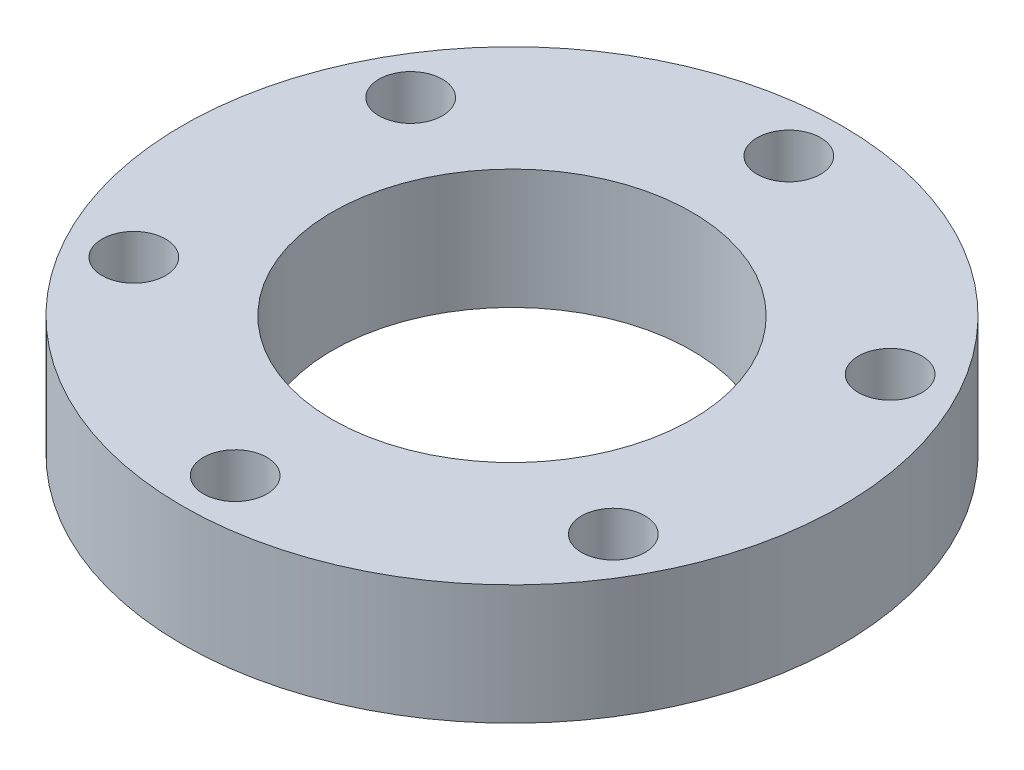
ISO-10303-21;
HEADER;
FILE_DESCRIPTION(('STEP AP214'),'2;1');
FILE_NAME('part.step','',(''),(''),'','','');
FILE_SCHEMA(('AUTOMOTIVE_DESIGN { 1 0 10303 214 1 1 1 1 }'));
ENDSEC;
DATA;
#1=APPLICATION_CONTEXT('core data for automotive mechanical design processes');
#2=APPLICATION_PROTOCOL_DEFINITION('international standard','automotive_design',2000,#1);
#3=PRODUCT_CONTEXT('',#1,'mechanical');
#4=PRODUCT('Part','Part','',(#3));
#5=PRODUCT_RELATED_PRODUCT_CATEGORY('part','',(#4));
#6=PRODUCT_DEFINITION_FORMATION('','',#4);
#7=PRODUCT_DEFINITION_CONTEXT('part definition',#1,'design');
#8=PRODUCT_DEFINITION('design','',#6,#7);
#9=PRODUCT_DEFINITION_SHAPE('','',#8);
#10=(LENGTH_UNIT() NAMED_UNIT(*) SI_UNIT(.MILLI.,.METRE.));
#11=(NAMED_UNIT(*) PLANE_ANGLE_UNIT() SI_UNIT($,.RADIAN.));
#12=(NAMED_UNIT(*) SI_UNIT($,.STERADIAN.) SOLID_ANGLE_UNIT());
#13=UNCERTAINTY_MEASURE_WITH_UNIT(LENGTH_MEASURE(1.E-05),#10,'distance_accuracy_value','');
#14=(GEOMETRIC_REPRESENTATION_CONTEXT(3) GLOBAL_UNCERTAINTY_ASSIGNED_CONTEXT((#13)) GLOBAL_UNIT_ASSIGNED_CONTEXT((#10,
#11,#12)) REPRESENTATION_CONTEXT('',''));
#15=CARTESIAN_POINT('',(0.,0.,0.));
#16=DIRECTION('',(0.,0.,1.));
#17=DIRECTION('',(1.,0.,0.));
#18=AXIS2_PLACEMENT_3D('',#15,#16,#17);
#19=CARTESIAN_POINT('',(0.,12.7,0.));
#20=DIRECTION('',(0.,1.,0.));
#21=DIRECTION('',(0.,0.,1.));
#22=AXIS2_PLACEMENT_3D('',#19,#20,#21);
#23=PLANE('',#22);
#24=CARTESIAN_POINT('',(25.4065872708242,12.7,14.6684999999998));
#25=DIRECTION('',(0.,1.,0.));
#26=DIRECTION('',(-0.866025403784443,0.,-0.499999999999992));
#27=AXIS2_PLACEMENT_3D('',#24,#25,#26);
#28=CIRCLE('',#27,3.3655);
#29=CARTESIAN_POINT('',(22.4919787743877,12.7,12.9857499999998));
#30=VERTEX_POINT('',#29);
#31=EDGE_CURVE('E70',#30,#30,#28,.T.);
#32=ORIENTED_EDGE('',*,*,#31,.F.);
#33=EDGE_LOOP('',(#32));
#34=FACE_BOUND('',#33,.T.);
#35=CARTESIAN_POINT('',(-25.406587270824,12.7,14.6685000000001));
#36=DIRECTION('',(0.,1.,0.));
#37=DIRECTION('',(0.866025403784436,0.,-0.500000000000004));
#38=AXIS2_PLACEMENT_3D('',#35,#36,#37);
#39=CIRCLE('',#38,3.3655);
#40=CARTESIAN_POINT('',(-22.4919787743875,12.7,12.9857500000001));
#41=VERTEX_POINT('',#40);
#42=EDGE_CURVE('E58',#41,#41,#39,.T.);
#43=ORIENTED_EDGE('',*,*,#42,.F.);
#44=EDGE_LOOP('',(#43));
#45=FACE_BOUND('',#44,.T.);
#46=CARTESIAN_POINT('',(0.,12.7,-29.337));
#47=DIRECTION('',(0.,1.,0.));
#48=DIRECTION('',(0.,0.,1.));
#49=AXIS2_PLACEMENT_3D('',#46,#47,#48);
#50=CIRCLE('',#49,3.3655);
#51=CARTESIAN_POINT('',(0.,12.7,-25.9715));
#52=VERTEX_POINT('',#51);
#53=EDGE_CURVE('E46',#52,#52,#50,.T.);
#54=ORIENTED_EDGE('',*,*,#53,.F.);
#55=EDGE_LOOP('',(#54));
#56=FACE_BOUND('',#55,.T.);
#57=CARTESIAN_POINT('',(0.,12.7,0.));
#58=DIRECTION('',(0.,1.,0.));
#59=DIRECTION('',(0.,0.,1.));
#60=AXIS2_PLACEMENT_3D('',#57,#58,#59);
#61=CIRCLE('',#60,34.925);
#62=CARTESIAN_POINT('',(0.,12.7,34.925));
#63=VERTEX_POINT('',#62);
#64=EDGE_CURVE('E10',#63,#63,#61,.T.);
#65=ORIENTED_EDGE('',*,*,#64,.T.);
#66=EDGE_LOOP('',(#65));
#67=FACE_BOUND('',#66,.T.);
#68=CARTESIAN_POINT('',(0.,12.7,0.));
#69=DIRECTION('',(0.,1.,0.));
#70=DIRECTION('',(0.,0.,1.));
#71=AXIS2_PLACEMENT_3D('',#68,#69,#70);
#72=CIRCLE('',#71,19.05);
#73=CARTESIAN_POINT('',(0.,12.7,19.05));
#74=VERTEX_POINT('',#73);
#75=EDGE_CURVE('E41',#74,#74,#72,.T.);
#76=ORIENTED_EDGE('',*,*,#75,.F.);
#77=EDGE_LOOP('',(#76));
#78=FACE_BOUND('',#77,.T.);
#79=CARTESIAN_POINT('',(-25.4065872708241,12.7,-14.6684999999999));
#80=DIRECTION('',(0.,1.,0.));
#81=DIRECTION('',(0.86602540378444,0.,0.499999999999998));
#82=AXIS2_PLACEMENT_3D('',#79,#80,#81);
#83=CIRCLE('',#82,3.3655);
#84=CARTESIAN_POINT('',(-22.4919787743876,12.7,-12.9857499999999));
#85=VERTEX_POINT('',#84);
#86=EDGE_CURVE('E52',#85,#85,#83,.T.);
#87=ORIENTED_EDGE('',*,*,#86,.F.);
#88=EDGE_LOOP('',(#87));
#89=FACE_BOUND('',#88,.T.);
#90=CARTESIAN_POINT('',(2.04859176075282E-13,12.7,29.337));
#91=DIRECTION('',(0.,1.,0.));
#92=DIRECTION('',(0.,0.,-1.));
#93=AXIS2_PLACEMENT_3D('',#90,#91,#92);
#94=CIRCLE('',#93,3.3655);
#95=CARTESIAN_POINT('',(1.81358015183529E-13,12.7,25.9715));
#96=VERTEX_POINT('',#95);
#97=EDGE_CURVE('E64',#96,#96,#94,.T.);
#98=ORIENTED_EDGE('',*,*,#97,.F.);
#99=EDGE_LOOP('',(#98));
#100=FACE_BOUND('',#99,.T.);
#101=CARTESIAN_POINT('',(25.4065872708239,12.7,-14.6685000000003));
#102=DIRECTION('',(0.,1.,0.));
#103=DIRECTION('',(-0.866025403784433,0.,0.50000000000001));
#104=AXIS2_PLACEMENT_3D('',#101,#102,#103);
#105=CIRCLE('',#104,3.3655);
#106=CARTESIAN_POINT('',(22.4919787743874,12.7,-12.9857500000003));
#107=VERTEX_POINT('',#106);
#108=EDGE_CURVE('E76',#107,#107,#105,.T.);
#109=ORIENTED_EDGE('',*,*,#108,.F.);
#110=EDGE_LOOP('',(#109));
#111=FACE_BOUND('',#110,.T.);
#112=ADVANCED_FACE('F30',(#34,#45,#56,#67,#78,#89,#100,#111),#23,.T.);
#113=CARTESIAN_POINT('',(0.,0.,0.));
#114=DIRECTION('',(0.,1.,0.));
#115=DIRECTION('',(0.,0.,1.));
#116=AXIS2_PLACEMENT_3D('',#113,#114,#115);
#117=PLANE('',#116);
#118=CARTESIAN_POINT('',(25.4065872708242,0.,14.6684999999998));
#119=DIRECTION('',(0.,1.,0.));
#120=DIRECTION('',(-0.866025403784443,0.,-0.499999999999992));
#121=AXIS2_PLACEMENT_3D('',#118,#119,#120);
#122=CIRCLE('',#121,3.3655);
#123=CARTESIAN_POINT('',(22.4919787743877,0.,12.9857499999998));
#124=VERTEX_POINT('',#123);
#125=EDGE_CURVE('E73',#124,#124,#122,.T.);
#126=ORIENTED_EDGE('',*,*,#125,.T.);
#127=EDGE_LOOP('',(#126));
#128=FACE_BOUND('',#127,.T.);
#129=CARTESIAN_POINT('',(-25.406587270824,0.,14.6685000000001));
#130=DIRECTION('',(0.,1.,0.));
#131=DIRECTION('',(0.866025403784436,0.,-0.500000000000004));
#132=AXIS2_PLACEMENT_3D('',#129,#130,#131);
#133=CIRCLE('',#132,3.3655);
#134=CARTESIAN_POINT('',(-22.4919787743875,0.,12.9857500000001));
#135=VERTEX_POINT('',#134);
#136=EDGE_CURVE('E61',#135,#135,#133,.T.);
#137=ORIENTED_EDGE('',*,*,#136,.T.);
#138=EDGE_LOOP('',(#137));
#139=FACE_BOUND('',#138,.T.);
#140=CARTESIAN_POINT('',(0.,0.,-29.337));
#141=DIRECTION('',(0.,1.,0.));
#142=DIRECTION('',(0.,0.,1.));
#143=AXIS2_PLACEMENT_3D('',#140,#141,#142);
#144=CIRCLE('',#143,3.3655);
#145=CARTESIAN_POINT('',(0.,0.,-25.9715));
#146=VERTEX_POINT('',#145);
#147=EDGE_CURVE('E49',#146,#146,#144,.T.);
#148=ORIENTED_EDGE('',*,*,#147,.T.);
#149=EDGE_LOOP('',(#148));
#150=FACE_BOUND('',#149,.T.);
#151=CARTESIAN_POINT('',(0.,0.,0.));
#152=DIRECTION('',(0.,1.,0.));
#153=DIRECTION('',(0.,0.,1.));
#154=AXIS2_PLACEMENT_3D('',#151,#152,#153);
#155=CIRCLE('',#154,34.925);
#156=CARTESIAN_POINT('',(0.,0.,34.925));
#157=VERTEX_POINT('',#156);
#158=EDGE_CURVE('E34',#157,#157,#155,.T.);
#159=ORIENTED_EDGE('',*,*,#158,.F.);
#160=EDGE_LOOP('',(#159));
#161=FACE_BOUND('',#160,.T.);
#162=CARTESIAN_POINT('',(0.,0.,0.));
#163=DIRECTION('',(0.,1.,0.));
#164=DIRECTION('',(0.,0.,1.));
#165=AXIS2_PLACEMENT_3D('',#162,#163,#164);
#166=CIRCLE('',#165,19.05);
#167=CARTESIAN_POINT('',(0.,0.,19.05));
#168=VERTEX_POINT('',#167);
#169=EDGE_CURVE('E43',#168,#168,#166,.T.);
#170=ORIENTED_EDGE('',*,*,#169,.T.);
#171=EDGE_LOOP('',(#170));
#172=FACE_BOUND('',#171,.T.);
#173=CARTESIAN_POINT('',(-25.4065872708241,0.,-14.6684999999999));
#174=DIRECTION('',(0.,1.,0.));
#175=DIRECTION('',(0.86602540378444,0.,0.499999999999998));
#176=AXIS2_PLACEMENT_3D('',#173,#174,#175);
#177=CIRCLE('',#176,3.3655);
#178=CARTESIAN_POINT('',(-22.4919787743876,0.,-12.9857499999999));
#179=VERTEX_POINT('',#178);
#180=EDGE_CURVE('E55',#179,#179,#177,.T.);
#181=ORIENTED_EDGE('',*,*,#180,.T.);
#182=EDGE_LOOP('',(#181));
#183=FACE_BOUND('',#182,.T.);
#184=CARTESIAN_POINT('',(2.04859176075282E-13,0.,29.337));
#185=DIRECTION('',(0.,1.,0.));
#186=DIRECTION('',(0.,0.,-1.));
#187=AXIS2_PLACEMENT_3D('',#184,#185,#186);
#188=CIRCLE('',#187,3.3655);
#189=CARTESIAN_POINT('',(1.81358015183529E-13,0.,25.9715));
#190=VERTEX_POINT('',#189);
#191=EDGE_CURVE('E67',#190,#190,#188,.T.);
#192=ORIENTED_EDGE('',*,*,#191,.T.);
#193=EDGE_LOOP('',(#192));
#194=FACE_BOUND('',#193,.T.);
#195=CARTESIAN_POINT('',(25.4065872708239,0.,-14.6685000000003));
#196=DIRECTION('',(0.,1.,0.));
#197=DIRECTION('',(-0.866025403784433,0.,0.50000000000001));
#198=AXIS2_PLACEMENT_3D('',#195,#196,#197);
#199=CIRCLE('',#198,3.3655);
#200=CARTESIAN_POINT('',(22.4919787743874,0.,-12.9857500000003));
#201=VERTEX_POINT('',#200);
#202=EDGE_CURVE('E79',#201,#201,#199,.T.);
#203=ORIENTED_EDGE('',*,*,#202,.T.);
#204=EDGE_LOOP('',(#203));
#205=FACE_BOUND('',#204,.T.);
#206=ADVANCED_FACE('F89',(#128,#139,#150,#161,#172,#183,#194,#205),#117,.F.);
#207=CARTESIAN_POINT('',(0.,12.7,0.));
#208=DIRECTION('',(0.,-1.,0.));
#209=DIRECTION('',(0.,0.,-1.));
#210=AXIS2_PLACEMENT_3D('',#207,#208,#209);
#211=CYLINDRICAL_SURFACE('',#210,34.925);
#212=ORIENTED_EDGE('',*,*,#64,.F.);
#213=EDGE_LOOP('',(#212));
#214=FACE_BOUND('',#213,.T.);
#215=ORIENTED_EDGE('',*,*,#158,.T.);
#216=EDGE_LOOP('',(#215));
#217=FACE_BOUND('',#216,.T.);
#218=ADVANCED_FACE('F32',(#214,#217),#211,.T.);
#219=CARTESIAN_POINT('',(0.,12.7,0.));
#220=DIRECTION('',(0.,-1.,0.));
#221=DIRECTION('',(0.,0.,-1.));
#222=AXIS2_PLACEMENT_3D('',#219,#220,#221);
#223=CYLINDRICAL_SURFACE('',#222,19.05);
#224=ORIENTED_EDGE('',*,*,#75,.T.);
#225=EDGE_LOOP('',(#224));
#226=FACE_BOUND('',#225,.T.);
#227=ORIENTED_EDGE('',*,*,#169,.F.);
#228=EDGE_LOOP('',(#227));
#229=FACE_BOUND('',#228,.T.);
#230=ADVANCED_FACE('F99',(#226,#229),#223,.F.);
#231=CARTESIAN_POINT('',(0.,12.7,-29.337));
#232=DIRECTION('',(0.,-1.,0.));
#233=DIRECTION('',(0.,0.,-1.));
#234=AXIS2_PLACEMENT_3D('',#231,#232,#233);
#235=CYLINDRICAL_SURFACE('',#234,3.3655);
#236=ORIENTED_EDGE('',*,*,#53,.T.);
#237=EDGE_LOOP('',(#236));
#238=FACE_BOUND('',#237,.T.);
#239=ORIENTED_EDGE('',*,*,#147,.F.);
#240=EDGE_LOOP('',(#239));
#241=FACE_BOUND('',#240,.T.);
#242=ADVANCED_FACE('F102',(#238,#241),#235,.F.);
#243=CARTESIAN_POINT('',(-25.4065872708241,12.7,-14.6684999999999));
#244=DIRECTION('',(0.,-1.,0.));
#245=DIRECTION('',(0.,0.,-1.));
#246=AXIS2_PLACEMENT_3D('',#243,#244,#245);
#247=CYLINDRICAL_SURFACE('',#246,3.3655);
#248=ORIENTED_EDGE('',*,*,#86,.T.);
#249=EDGE_LOOP('',(#248));
#250=FACE_BOUND('',#249,.T.);
#251=ORIENTED_EDGE('',*,*,#180,.F.);
#252=EDGE_LOOP('',(#251));
#253=FACE_BOUND('',#252,.T.);
#254=ADVANCED_FACE('F106',(#250,#253),#247,.F.);
#255=CARTESIAN_POINT('',(-25.406587270824,12.7,14.6685000000001));
#256=DIRECTION('',(0.,-1.,0.));
#257=DIRECTION('',(0.,0.,-1.));
#258=AXIS2_PLACEMENT_3D('',#255,#256,#257);
#259=CYLINDRICAL_SURFACE('',#258,3.3655);
#260=ORIENTED_EDGE('',*,*,#42,.T.);
#261=EDGE_LOOP('',(#260));
#262=FACE_BOUND('',#261,.T.);
#263=ORIENTED_EDGE('',*,*,#136,.F.);
#264=EDGE_LOOP('',(#263));
#265=FACE_BOUND('',#264,.T.);
#266=ADVANCED_FACE('F110',(#262,#265),#259,.F.);
#267=CARTESIAN_POINT('',(2.04859176075282E-13,12.7,29.337));
#268=DIRECTION('',(0.,-1.,0.));
#269=DIRECTION('',(0.,0.,-1.));
#270=AXIS2_PLACEMENT_3D('',#267,#268,#269);
#271=CYLINDRICAL_SURFACE('',#270,3.3655);
#272=ORIENTED_EDGE('',*,*,#97,.T.);
#273=EDGE_LOOP('',(#272));
#274=FACE_BOUND('',#273,.T.);
#275=ORIENTED_EDGE('',*,*,#191,.F.);
#276=EDGE_LOOP('',(#275));
#277=FACE_BOUND('',#276,.T.);
#278=ADVANCED_FACE('F114',(#274,#277),#271,.F.);
#279=CARTESIAN_POINT('',(25.4065872708242,12.7,14.6684999999998));
#280=DIRECTION('',(0.,-1.,0.));
#281=DIRECTION('',(0.,0.,-1.));
#282=AXIS2_PLACEMENT_3D('',#279,#280,#281);
#283=CYLINDRICAL_SURFACE('',#282,3.3655);
#284=ORIENTED_EDGE('',*,*,#31,.T.);
#285=EDGE_LOOP('',(#284));
#286=FACE_BOUND('',#285,.T.);
#287=ORIENTED_EDGE('',*,*,#125,.F.);
#288=EDGE_LOOP('',(#287));
#289=FACE_BOUND('',#288,.T.);
#290=ADVANCED_FACE('F118',(#286,#289),#283,.F.);
#291=CARTESIAN_POINT('',(25.4065872708239,12.7,-14.6685000000003));
#292=DIRECTION('',(0.,-1.,0.));
#293=DIRECTION('',(0.,0.,-1.));
#294=AXIS2_PLACEMENT_3D('',#291,#292,#293);
#295=CYLINDRICAL_SURFACE('',#294,3.3655);
#296=ORIENTED_EDGE('',*,*,#108,.T.);
#297=EDGE_LOOP('',(#296));
#298=FACE_BOUND('',#297,.T.);
#299=ORIENTED_EDGE('',*,*,#202,.F.);
#300=EDGE_LOOP('',(#299));
#301=FACE_BOUND('',#300,.T.);
#302=ADVANCED_FACE('F85',(#298,#301),#295,.F.);
#303=CLOSED_SHELL('',(#112,#206,#218,#230,#242,#254,#266,#278,#290,#302));
#304=MANIFOLD_SOLID_BREP('B2',#303);
#305=ADVANCED_BREP_SHAPE_REPRESENTATION('',(#18,#304),#14);
#306=SHAPE_DEFINITION_REPRESENTATION(#9,#305);
ENDSEC;
END-ISO-10303-21;
